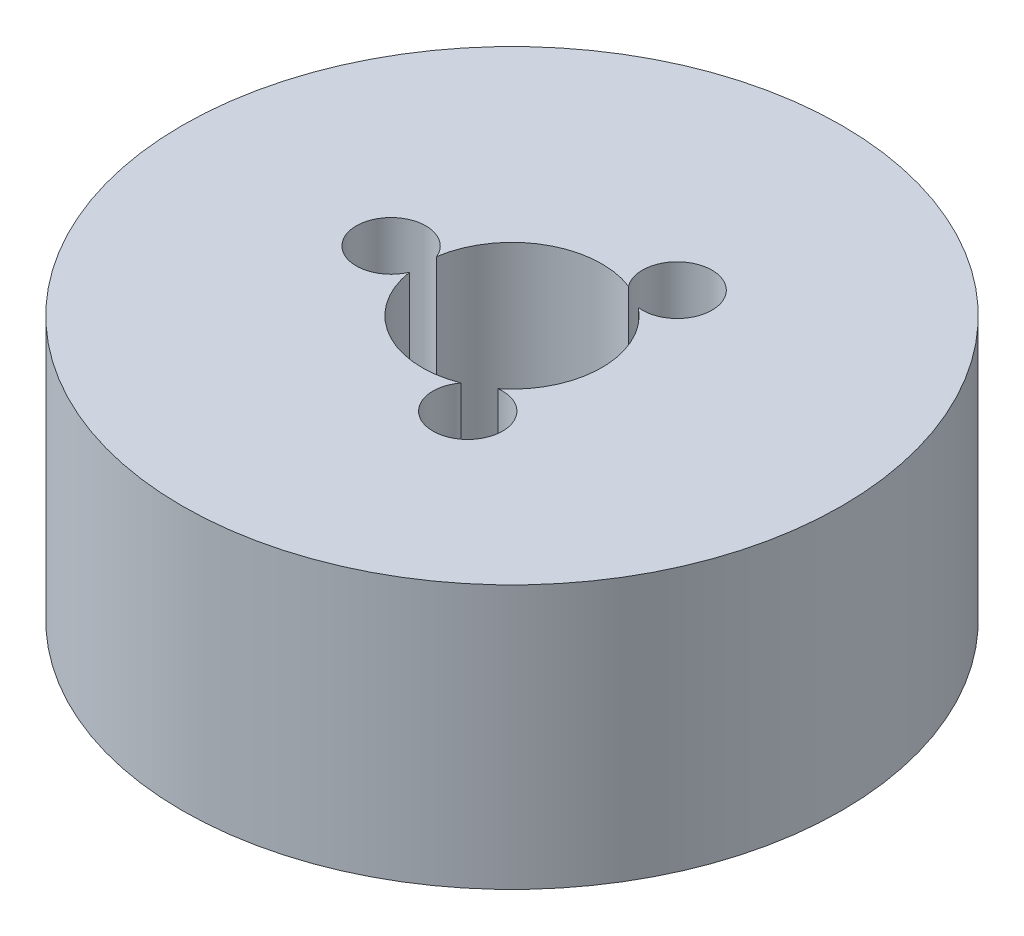
ISO-10303-21;
HEADER;
FILE_DESCRIPTION(('STEP AP214'),'2;1');
FILE_NAME('part.step','',(''),(''),'','','');
FILE_SCHEMA(('AUTOMOTIVE_DESIGN { 1 0 10303 214 1 1 1 1 }'));
ENDSEC;
DATA;
#1=APPLICATION_CONTEXT('core data for automotive mechanical design processes');
#2=APPLICATION_PROTOCOL_DEFINITION('international standard','automotive_design',2000,#1);
#3=PRODUCT_CONTEXT('',#1,'mechanical');
#4=PRODUCT('Part','Part','',(#3));
#5=PRODUCT_RELATED_PRODUCT_CATEGORY('part','',(#4));
#6=PRODUCT_DEFINITION_FORMATION('','',#4);
#7=PRODUCT_DEFINITION_CONTEXT('part definition',#1,'design');
#8=PRODUCT_DEFINITION('design','',#6,#7);
#9=PRODUCT_DEFINITION_SHAPE('','',#8);
#10=(LENGTH_UNIT() NAMED_UNIT(*) SI_UNIT(.MILLI.,.METRE.));
#11=(NAMED_UNIT(*) PLANE_ANGLE_UNIT() SI_UNIT($,.RADIAN.));
#12=(NAMED_UNIT(*) SI_UNIT($,.STERADIAN.) SOLID_ANGLE_UNIT());
#13=UNCERTAINTY_MEASURE_WITH_UNIT(LENGTH_MEASURE(1.E-05),#10,'distance_accuracy_value','');
#14=(GEOMETRIC_REPRESENTATION_CONTEXT(3) GLOBAL_UNCERTAINTY_ASSIGNED_CONTEXT((#13)) GLOBAL_UNIT_ASSIGNED_CONTEXT((#10,
#11,#12)) REPRESENTATION_CONTEXT('',''));
#15=CARTESIAN_POINT('',(0.,0.,0.));
#16=DIRECTION('',(0.,0.,1.));
#17=DIRECTION('',(1.,0.,0.));
#18=AXIS2_PLACEMENT_3D('',#15,#16,#17);
#19=CARTESIAN_POINT('',(0.,22.,0.));
#20=DIRECTION('',(0.,-1.,0.));
#21=DIRECTION('',(0.,0.,-1.));
#22=AXIS2_PLACEMENT_3D('',#19,#20,#21);
#23=CYLINDRICAL_SURFACE('',#22,27.5);
#24=CARTESIAN_POINT('',(0.,22.,0.));
#25=DIRECTION('',(0.,1.,0.));
#26=DIRECTION('',(0.,0.,1.));
#27=AXIS2_PLACEMENT_3D('',#24,#25,#26);
#28=CIRCLE('',#27,27.5);
#29=CARTESIAN_POINT('',(0.,22.,27.5));
#30=VERTEX_POINT('',#29);
#31=EDGE_CURVE('E126',#30,#30,#28,.T.);
#32=ORIENTED_EDGE('',*,*,#31,.F.);
#33=EDGE_LOOP('',(#32));
#34=FACE_BOUND('',#33,.T.);
#35=CARTESIAN_POINT('',(0.,0.,0.));
#36=DIRECTION('',(0.,1.,0.));
#37=DIRECTION('',(0.,0.,1.));
#38=AXIS2_PLACEMENT_3D('',#35,#36,#37);
#39=CIRCLE('',#38,27.5);
#40=CARTESIAN_POINT('',(0.,0.,27.5));
#41=VERTEX_POINT('',#40);
#42=EDGE_CURVE('E124',#41,#41,#39,.T.);
#43=ORIENTED_EDGE('',*,*,#42,.T.);
#44=EDGE_LOOP('',(#43));
#45=FACE_BOUND('',#44,.T.);
#46=ADVANCED_FACE('F39',(#34,#45),#23,.T.);
#47=CARTESIAN_POINT('',(0.,22.,0.));
#48=DIRECTION('',(0.,1.,0.));
#49=DIRECTION('',(0.,0.,1.));
#50=AXIS2_PLACEMENT_3D('',#47,#48,#49);
#51=PLANE('',#50);
#52=CARTESIAN_POINT('',(5.043153548245,22.,8.7349981759315));
#53=DIRECTION('',(0.,1.,0.));
#54=DIRECTION('',(0.866025403784436,0.,-0.500000000000004));
#55=AXIS2_PLACEMENT_3D('',#52,#53,#54);
#56=CIRCLE('',#55,2.90116691752156);
#57=CARTESIAN_POINT('',(2.72836911208401,22.,6.98612925647858));
#58=VERTEX_POINT('',#57);
#59=CARTESIAN_POINT('',(4.68598085419019,22.,5.85590159020479));
#60=VERTEX_POINT('',#59);
#61=EDGE_CURVE('E147',#58,#60,#56,.T.);
#62=ORIENTED_EDGE('',*,*,#61,.F.);
#63=CARTESIAN_POINT('',(0.,22.,0.));
#64=DIRECTION('',(0.,1.,0.));
#65=DIRECTION('',(0.,0.,1.));
#66=AXIS2_PLACEMENT_3D('',#63,#64,#65);
#67=CIRCLE('',#66,7.5);
#68=CARTESIAN_POINT('',(-7.41434996627414,22.,1.13022766627378));
#69=VERTEX_POINT('',#68);
#70=EDGE_CURVE('E118',#69,#58,#67,.T.);
#71=ORIENTED_EDGE('',*,*,#70,.F.);
#72=CARTESIAN_POINT('',(-10.0863070964899,22.,0.));
#73=DIRECTION('',(0.,1.,0.));
#74=DIRECTION('',(0.,0.,1.));
#75=AXIS2_PLACEMENT_3D('',#72,#73,#74);
#76=CIRCLE('',#75,2.90116691752156);
#77=CARTESIAN_POINT('',(-7.41434996627414,22.,-1.13022766627378));
#78=VERTEX_POINT('',#77);
#79=EDGE_CURVE('E113',#78,#69,#76,.T.);
#80=ORIENTED_EDGE('',*,*,#79,.F.);
#81=CARTESIAN_POINT('',(2.72836911208391,22.,-6.98612925647862));
#82=VERTEX_POINT('',#81);
#83=EDGE_CURVE('E106',#82,#78,#67,.T.);
#84=ORIENTED_EDGE('',*,*,#83,.F.);
#85=CARTESIAN_POINT('',(5.04315354824487,22.,-8.73499817593157));
#86=DIRECTION('',(0.,1.,0.));
#87=DIRECTION('',(-0.866025403784443,0.,-0.499999999999992));
#88=AXIS2_PLACEMENT_3D('',#85,#86,#87);
#89=CIRCLE('',#88,2.90116691752156);
#90=CARTESIAN_POINT('',(4.68598085419011,22.,-5.85590159020485));
#91=VERTEX_POINT('',#90);
#92=EDGE_CURVE('E90',#91,#82,#89,.T.);
#93=ORIENTED_EDGE('',*,*,#92,.F.);
#94=EDGE_CURVE('E116',#60,#91,#67,.T.);
#95=ORIENTED_EDGE('',*,*,#94,.F.);
#96=EDGE_LOOP('',(#62,#71,#80,#84,#93,#95));
#97=FACE_BOUND('',#96,.T.);
#98=ORIENTED_EDGE('',*,*,#31,.T.);
#99=EDGE_LOOP('',(#98));
#100=FACE_BOUND('',#99,.T.);
#101=ADVANCED_FACE('F115',(#97,#100),#51,.T.);
#102=CARTESIAN_POINT('',(0.,0.,0.));
#103=DIRECTION('',(0.,1.,0.));
#104=DIRECTION('',(0.,0.,1.));
#105=AXIS2_PLACEMENT_3D('',#102,#103,#104);
#106=PLANE('',#105);
#107=CARTESIAN_POINT('',(0.,0.,0.));
#108=DIRECTION('',(0.,1.,0.));
#109=DIRECTION('',(0.,0.,1.));
#110=AXIS2_PLACEMENT_3D('',#107,#108,#109);
#111=CIRCLE('',#110,7.5);
#112=CARTESIAN_POINT('',(0.,0.,7.5));
#113=VERTEX_POINT('',#112);
#114=EDGE_CURVE('E120',#113,#113,#111,.T.);
#115=ORIENTED_EDGE('',*,*,#114,.T.);
#116=EDGE_LOOP('',(#115));
#117=FACE_BOUND('',#116,.T.);
#118=ORIENTED_EDGE('',*,*,#42,.F.);
#119=EDGE_LOOP('',(#118));
#120=FACE_BOUND('',#119,.T.);
#121=ADVANCED_FACE('F164',(#117,#120),#106,.F.);
#122=CARTESIAN_POINT('',(0.,22.,0.));
#123=DIRECTION('',(0.,-1.,0.));
#124=DIRECTION('',(0.,0.,-1.));
#125=AXIS2_PLACEMENT_3D('',#122,#123,#124);
#126=CYLINDRICAL_SURFACE('',#125,7.5);
#127=DIRECTION('',(0.,1.,0.));
#128=VECTOR('',#127,1.);
#129=CARTESIAN_POINT('',(2.728369112084,15.0340775579281,6.98612925647858));
#130=LINE('',#129,#128);
#131=CARTESIAN_POINT('',(2.72836911208401,8.0681551158563,6.98612925647858));
#132=VERTEX_POINT('',#131);
#133=EDGE_CURVE('E11',#132,#58,#130,.T.);
#134=ORIENTED_EDGE('',*,*,#133,.F.);
#135=CARTESIAN_POINT('',(0.,8.0681551158563,0.));
#136=DIRECTION('',(0.,1.,0.));
#137=DIRECTION('',(0.,0.,1.));
#138=AXIS2_PLACEMENT_3D('',#135,#136,#137);
#139=CIRCLE('',#138,7.5);
#140=CARTESIAN_POINT('',(4.68598085419019,8.0681551158563,5.85590159020479));
#141=VERTEX_POINT('',#140);
#142=EDGE_CURVE('E144',#132,#141,#139,.T.);
#143=ORIENTED_EDGE('',*,*,#142,.T.);
#144=DIRECTION('',(0.,1.,0.));
#145=VECTOR('',#144,1.);
#146=CARTESIAN_POINT('',(4.6859808541902,15.0340775579281,5.85590159020479));
#147=LINE('',#146,#145);
#148=EDGE_CURVE('E46',#60,#141,#147,.F.);
#149=ORIENTED_EDGE('',*,*,#148,.F.);
#150=ORIENTED_EDGE('',*,*,#94,.T.);
#151=DIRECTION('',(0.,1.,0.));
#152=VECTOR('',#151,1.);
#153=CARTESIAN_POINT('',(4.68598085419012,15.0340775579281,-5.85590159020485));
#154=LINE('',#153,#152);
#155=CARTESIAN_POINT('',(4.68598085419011,8.0681551158563,-5.85590159020485));
#156=VERTEX_POINT('',#155);
#157=EDGE_CURVE('E92',#156,#91,#154,.T.);
#158=ORIENTED_EDGE('',*,*,#157,.F.);
#159=CARTESIAN_POINT('',(0.,8.0681551158563,0.));
#160=DIRECTION('',(0.,1.,0.));
#161=DIRECTION('',(0.,0.,1.));
#162=AXIS2_PLACEMENT_3D('',#159,#160,#161);
#163=CIRCLE('',#162,7.5);
#164=CARTESIAN_POINT('',(2.72836911208391,8.0681551158563,-6.98612925647862));
#165=VERTEX_POINT('',#164);
#166=EDGE_CURVE('E107',#156,#165,#163,.T.);
#167=ORIENTED_EDGE('',*,*,#166,.T.);
#168=DIRECTION('',(0.,1.,0.));
#169=VECTOR('',#168,1.);
#170=CARTESIAN_POINT('',(2.7283691120839,15.0340775579281,-6.98612925647862));
#171=LINE('',#170,#169);
#172=EDGE_CURVE('E95',#82,#165,#171,.F.);
#173=ORIENTED_EDGE('',*,*,#172,.F.);
#174=ORIENTED_EDGE('',*,*,#83,.T.);
#175=DIRECTION('',(0.,1.,0.));
#176=VECTOR('',#175,1.);
#177=CARTESIAN_POINT('',(-7.41434996627414,15.0340775579281,-1.13022766627379));
#178=LINE('',#177,#176);
#179=CARTESIAN_POINT('',(-7.41434996627414,8.0681551158563,-1.13022766627378));
#180=VERTEX_POINT('',#179);
#181=EDGE_CURVE('E143',#180,#78,#178,.T.);
#182=ORIENTED_EDGE('',*,*,#181,.F.);
#183=CARTESIAN_POINT('',(0.,8.0681551158563,0.));
#184=DIRECTION('',(0.,1.,0.));
#185=DIRECTION('',(0.,0.,1.));
#186=AXIS2_PLACEMENT_3D('',#183,#184,#185);
#187=CIRCLE('',#186,7.5);
#188=CARTESIAN_POINT('',(-7.41434996627414,8.0681551158563,1.13022766627378));
#189=VERTEX_POINT('',#188);
#190=EDGE_CURVE('E132',#180,#189,#187,.T.);
#191=ORIENTED_EDGE('',*,*,#190,.T.);
#192=DIRECTION('',(0.,1.,0.));
#193=VECTOR('',#192,1.);
#194=CARTESIAN_POINT('',(-7.41434996627414,15.0340775579281,1.13022766627379));
#195=LINE('',#194,#193);
#196=EDGE_CURVE('E137',#69,#189,#195,.F.);
#197=ORIENTED_EDGE('',*,*,#196,.F.);
#198=ORIENTED_EDGE('',*,*,#70,.T.);
#199=EDGE_LOOP('',(#134,#143,#149,#150,#158,#167,#173,#174,#182,#191,#197,#198));
#200=FACE_BOUND('',#199,.T.);
#201=ORIENTED_EDGE('',*,*,#114,.F.);
#202=EDGE_LOOP('',(#201));
#203=FACE_BOUND('',#202,.T.);
#204=ADVANCED_FACE('F103',(#200,#203),#126,.F.);
#205=CARTESIAN_POINT('',(-10.0863070964899,8.0681551158563,0.));
#206=DIRECTION('',(0.,1.,0.));
#207=DIRECTION('',(0.,0.,1.));
#208=AXIS2_PLACEMENT_3D('',#205,#206,#207);
#209=CYLINDRICAL_SURFACE('',#208,2.90116691752156);
#210=ORIENTED_EDGE('',*,*,#181,.T.);
#211=ORIENTED_EDGE('',*,*,#79,.T.);
#212=ORIENTED_EDGE('',*,*,#196,.T.);
#213=CARTESIAN_POINT('',(-10.0863070964899,8.0681551158563,0.));
#214=DIRECTION('',(0.,1.,0.));
#215=DIRECTION('',(0.,0.,1.));
#216=AXIS2_PLACEMENT_3D('',#213,#214,#215);
#217=CIRCLE('',#216,2.90116691752156);
#218=EDGE_CURVE('E121',#180,#189,#217,.T.);
#219=ORIENTED_EDGE('',*,*,#218,.F.);
#220=EDGE_LOOP('',(#210,#211,#212,#219));
#221=FACE_BOUND('',#220,.T.);
#222=ADVANCED_FACE('F174',(#221),#209,.F.);
#223=CARTESIAN_POINT('',(-10.0863070964899,8.0681551158563,0.));
#224=DIRECTION('',(0.,1.,0.));
#225=DIRECTION('',(0.,0.,1.));
#226=AXIS2_PLACEMENT_3D('',#223,#224,#225);
#227=PLANE('',#226);
#228=ORIENTED_EDGE('',*,*,#218,.T.);
#229=ORIENTED_EDGE('',*,*,#190,.F.);
#230=EDGE_LOOP('',(#228,#229));
#231=FACE_BOUND('',#230,.T.);
#232=ADVANCED_FACE('F177',(#231),#227,.T.);
#233=CARTESIAN_POINT('',(5.04315354824487,8.0681551158563,-8.73499817593157));
#234=DIRECTION('',(0.,1.,0.));
#235=DIRECTION('',(0.,0.,1.));
#236=AXIS2_PLACEMENT_3D('',#233,#234,#235);
#237=CYLINDRICAL_SURFACE('',#236,2.90116691752156);
#238=ORIENTED_EDGE('',*,*,#157,.T.);
#239=ORIENTED_EDGE('',*,*,#92,.T.);
#240=ORIENTED_EDGE('',*,*,#172,.T.);
#241=CARTESIAN_POINT('',(5.04315354824487,8.0681551158563,-8.73499817593157));
#242=DIRECTION('',(0.,1.,0.));
#243=DIRECTION('',(-0.866025403784443,0.,-0.499999999999992));
#244=AXIS2_PLACEMENT_3D('',#241,#242,#243);
#245=CIRCLE('',#244,2.90116691752156);
#246=EDGE_CURVE('E56',#156,#165,#245,.T.);
#247=ORIENTED_EDGE('',*,*,#246,.F.);
#248=EDGE_LOOP('',(#238,#239,#240,#247));
#249=FACE_BOUND('',#248,.T.);
#250=ADVANCED_FACE('F93',(#249),#237,.F.);
#251=CARTESIAN_POINT('',(5.04315354824487,8.0681551158563,-8.73499817593157));
#252=DIRECTION('',(0.,1.,0.));
#253=DIRECTION('',(-0.866025403784443,0.,-0.499999999999992));
#254=AXIS2_PLACEMENT_3D('',#251,#252,#253);
#255=PLANE('',#254);
#256=ORIENTED_EDGE('',*,*,#246,.T.);
#257=ORIENTED_EDGE('',*,*,#166,.F.);
#258=EDGE_LOOP('',(#256,#257));
#259=FACE_BOUND('',#258,.T.);
#260=ADVANCED_FACE('F160',(#259),#255,.T.);
#261=CARTESIAN_POINT('',(5.043153548245,8.0681551158563,8.7349981759315));
#262=DIRECTION('',(0.,1.,0.));
#263=DIRECTION('',(0.,0.,1.));
#264=AXIS2_PLACEMENT_3D('',#261,#262,#263);
#265=CYLINDRICAL_SURFACE('',#264,2.90116691752156);
#266=ORIENTED_EDGE('',*,*,#133,.T.);
#267=ORIENTED_EDGE('',*,*,#61,.T.);
#268=ORIENTED_EDGE('',*,*,#148,.T.);
#269=CARTESIAN_POINT('',(5.043153548245,8.0681551158563,8.7349981759315));
#270=DIRECTION('',(0.,1.,0.));
#271=DIRECTION('',(0.866025403784436,0.,-0.500000000000004));
#272=AXIS2_PLACEMENT_3D('',#269,#270,#271);
#273=CIRCLE('',#272,2.90116691752156);
#274=EDGE_CURVE('E55',#132,#141,#273,.T.);
#275=ORIENTED_EDGE('',*,*,#274,.F.);
#276=EDGE_LOOP('',(#266,#267,#268,#275));
#277=FACE_BOUND('',#276,.T.);
#278=ADVANCED_FACE('F149',(#277),#265,.F.);
#279=CARTESIAN_POINT('',(5.043153548245,8.0681551158563,8.7349981759315));
#280=DIRECTION('',(0.,1.,0.));
#281=DIRECTION('',(0.866025403784436,0.,-0.500000000000004));
#282=AXIS2_PLACEMENT_3D('',#279,#280,#281);
#283=PLANE('',#282);
#284=ORIENTED_EDGE('',*,*,#274,.T.);
#285=ORIENTED_EDGE('',*,*,#142,.F.);
#286=EDGE_LOOP('',(#284,#285));
#287=FACE_BOUND('',#286,.T.);
#288=ADVANCED_FACE('F151',(#287),#283,.T.);
#289=CLOSED_SHELL('',(#46,#101,#121,#204,#222,#232,#250,#260,#278,#288));
#290=MANIFOLD_SOLID_BREP('B2',#289);
#291=ADVANCED_BREP_SHAPE_REPRESENTATION('',(#18,#290),#14);
#292=SHAPE_DEFINITION_REPRESENTATION(#9,#291);
ENDSEC;
END-ISO-10303-21;
